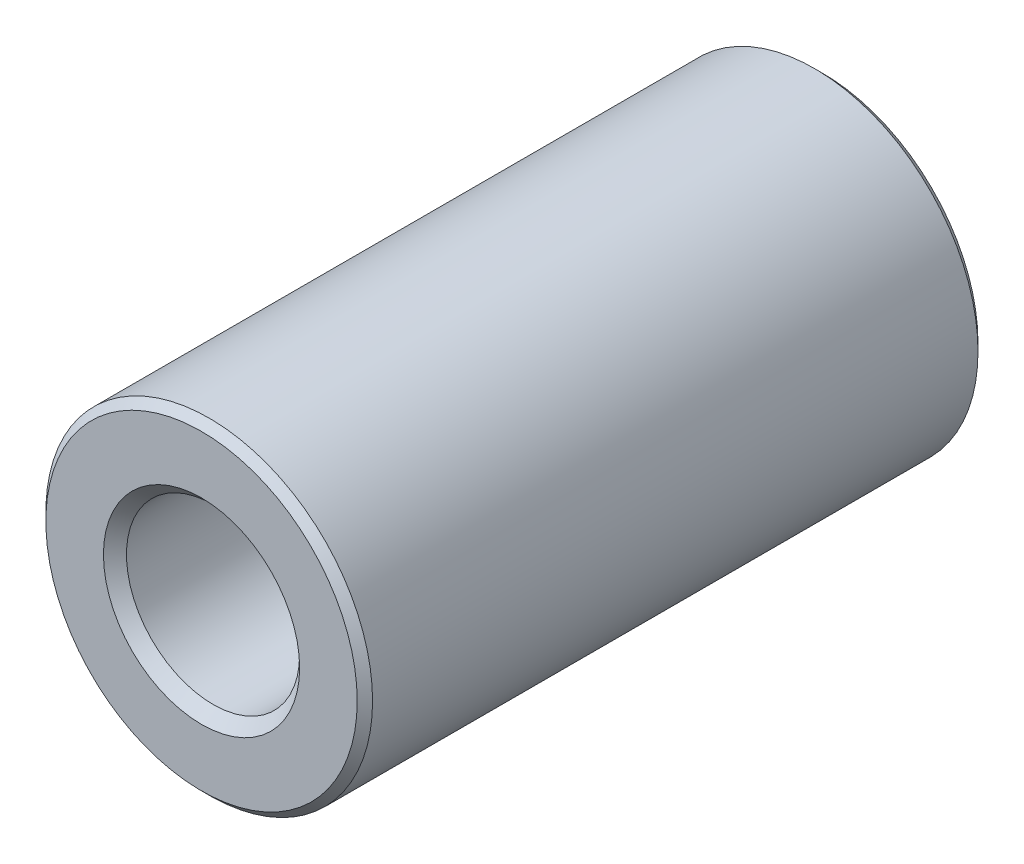
ISO-10303-21;
HEADER;
FILE_DESCRIPTION(('STEP AP214'),'2;1');
FILE_NAME('part.step','',(''),(''),'','','');
FILE_SCHEMA(('AUTOMOTIVE_DESIGN { 1 0 10303 214 1 1 1 1 }'));
ENDSEC;
DATA;
#1=APPLICATION_CONTEXT('core data for automotive mechanical design processes');
#2=APPLICATION_PROTOCOL_DEFINITION('international standard','automotive_design',2000,#1);
#3=PRODUCT_CONTEXT('',#1,'mechanical');
#4=PRODUCT('Part','Part','',(#3));
#5=PRODUCT_RELATED_PRODUCT_CATEGORY('part','',(#4));
#6=PRODUCT_DEFINITION_FORMATION('','',#4);
#7=PRODUCT_DEFINITION_CONTEXT('part definition',#1,'design');
#8=PRODUCT_DEFINITION('design','',#6,#7);
#9=PRODUCT_DEFINITION_SHAPE('','',#8);
#10=(LENGTH_UNIT() NAMED_UNIT(*) SI_UNIT(.MILLI.,.METRE.));
#11=(NAMED_UNIT(*) PLANE_ANGLE_UNIT() SI_UNIT($,.RADIAN.));
#12=(NAMED_UNIT(*) SI_UNIT($,.STERADIAN.) SOLID_ANGLE_UNIT());
#13=UNCERTAINTY_MEASURE_WITH_UNIT(LENGTH_MEASURE(1.E-05),#10,'distance_accuracy_value','');
#14=(GEOMETRIC_REPRESENTATION_CONTEXT(3) GLOBAL_UNCERTAINTY_ASSIGNED_CONTEXT((#13)) GLOBAL_UNIT_ASSIGNED_CONTEXT((#10,
#11,#12)) REPRESENTATION_CONTEXT('',''));
#15=CARTESIAN_POINT('',(0.,0.,0.));
#16=DIRECTION('',(0.,0.,1.));
#17=DIRECTION('',(1.,0.,0.));
#18=AXIS2_PLACEMENT_3D('',#15,#16,#17);
#19=CARTESIAN_POINT('',(0.,0.,-9.5));
#20=DIRECTION('',(0.,0.,1.));
#21=DIRECTION('',(1.,0.,0.));
#22=AXIS2_PLACEMENT_3D('',#19,#20,#21);
#23=CYLINDRICAL_SURFACE('',#22,5.);
#24=CARTESIAN_POINT('',(0.,0.,9.265));
#25=DIRECTION('',(0.,0.,1.));
#26=DIRECTION('',(1.,0.,0.));
#27=AXIS2_PLACEMENT_3D('',#24,#25,#26);
#28=CIRCLE('',#27,5.);
#29=CARTESIAN_POINT('',(5.,0.,9.265));
#30=VERTEX_POINT('',#29);
#31=EDGE_CURVE('E58',#30,#30,#28,.F.);
#32=ORIENTED_EDGE('',*,*,#31,.T.);
#33=EDGE_LOOP('',(#32));
#34=FACE_BOUND('',#33,.T.);
#35=CARTESIAN_POINT('',(0.,0.,-9.265));
#36=DIRECTION('',(0.,0.,1.));
#37=DIRECTION('',(1.,0.,0.));
#38=AXIS2_PLACEMENT_3D('',#35,#36,#37);
#39=CIRCLE('',#38,5.);
#40=CARTESIAN_POINT('',(5.,0.,-9.265));
#41=VERTEX_POINT('',#40);
#42=EDGE_CURVE('E61',#41,#41,#39,.T.);
#43=ORIENTED_EDGE('',*,*,#42,.T.);
#44=EDGE_LOOP('',(#43));
#45=FACE_BOUND('',#44,.T.);
#46=ADVANCED_FACE('F35',(#34,#45),#23,.T.);
#47=CARTESIAN_POINT('',(0.,0.,-9.5));
#48=DIRECTION('',(0.,0.,1.));
#49=DIRECTION('',(1.,0.,0.));
#50=AXIS2_PLACEMENT_3D('',#47,#48,#49);
#51=PLANE('',#50);
#52=CARTESIAN_POINT('',(0.,0.,-9.5));
#53=DIRECTION('',(0.,0.,1.));
#54=DIRECTION('',(1.,0.,0.));
#55=AXIS2_PLACEMENT_3D('',#52,#53,#54);
#56=CIRCLE('',#55,3.0025);
#57=CARTESIAN_POINT('',(3.0025,0.,-9.5));
#58=VERTEX_POINT('',#57);
#59=EDGE_CURVE('E10',#58,#58,#56,.T.);
#60=ORIENTED_EDGE('',*,*,#59,.T.);
#61=EDGE_LOOP('',(#60));
#62=FACE_BOUND('',#61,.T.);
#63=CARTESIAN_POINT('',(0.,0.,-9.5));
#64=DIRECTION('',(0.,0.,1.));
#65=DIRECTION('',(1.,0.,0.));
#66=AXIS2_PLACEMENT_3D('',#63,#64,#65);
#67=CIRCLE('',#66,4.765);
#68=CARTESIAN_POINT('',(4.765,0.,-9.5));
#69=VERTEX_POINT('',#68);
#70=EDGE_CURVE('E55',#69,#69,#67,.F.);
#71=ORIENTED_EDGE('',*,*,#70,.T.);
#72=EDGE_LOOP('',(#71));
#73=FACE_BOUND('',#72,.T.);
#74=ADVANCED_FACE('F87',(#62,#73),#51,.F.);
#75=CARTESIAN_POINT('',(0.,0.,-9.5));
#76=DIRECTION('',(0.,0.,1.));
#77=DIRECTION('',(1.,0.,0.));
#78=AXIS2_PLACEMENT_3D('',#75,#76,#77);
#79=CYLINDRICAL_SURFACE('',#78,2.65);
#80=CARTESIAN_POINT('',(0.,0.,9.1475));
#81=DIRECTION('',(0.,0.,1.));
#82=DIRECTION('',(1.,0.,0.));
#83=AXIS2_PLACEMENT_3D('',#80,#81,#82);
#84=CIRCLE('',#83,2.65);
#85=CARTESIAN_POINT('',(2.65,0.,9.1475));
#86=VERTEX_POINT('',#85);
#87=EDGE_CURVE('E46',#86,#86,#84,.T.);
#88=ORIENTED_EDGE('',*,*,#87,.T.);
#89=EDGE_LOOP('',(#88));
#90=FACE_BOUND('',#89,.T.);
#91=CARTESIAN_POINT('',(0.,0.,-9.1475));
#92=DIRECTION('',(0.,0.,1.));
#93=DIRECTION('',(1.,0.,0.));
#94=AXIS2_PLACEMENT_3D('',#91,#92,#93);
#95=CIRCLE('',#94,2.65);
#96=CARTESIAN_POINT('',(2.65,0.,-9.1475));
#97=VERTEX_POINT('',#96);
#98=EDGE_CURVE('E50',#97,#97,#95,.F.);
#99=ORIENTED_EDGE('',*,*,#98,.T.);
#100=EDGE_LOOP('',(#99));
#101=FACE_BOUND('',#100,.T.);
#102=ADVANCED_FACE('F83',(#90,#101),#79,.F.);
#103=CARTESIAN_POINT('',(0.,0.,9.5));
#104=DIRECTION('',(0.,0.,1.));
#105=DIRECTION('',(1.,0.,0.));
#106=AXIS2_PLACEMENT_3D('',#103,#104,#105);
#107=PLANE('',#106);
#108=CARTESIAN_POINT('',(0.,0.,9.5));
#109=DIRECTION('',(0.,0.,1.));
#110=DIRECTION('',(1.,0.,0.));
#111=AXIS2_PLACEMENT_3D('',#108,#109,#110);
#112=CIRCLE('',#111,3.0025);
#113=CARTESIAN_POINT('',(3.0025,0.,9.5));
#114=VERTEX_POINT('',#113);
#115=EDGE_CURVE('E42',#114,#114,#112,.F.);
#116=ORIENTED_EDGE('',*,*,#115,.T.);
#117=EDGE_LOOP('',(#116));
#118=FACE_BOUND('',#117,.T.);
#119=CARTESIAN_POINT('',(0.,0.,9.5));
#120=DIRECTION('',(0.,0.,1.));
#121=DIRECTION('',(1.,0.,0.));
#122=AXIS2_PLACEMENT_3D('',#119,#120,#121);
#123=CIRCLE('',#122,4.76500000000001);
#124=CARTESIAN_POINT('',(4.76500000000001,0.,9.5));
#125=VERTEX_POINT('',#124);
#126=EDGE_CURVE('E64',#125,#125,#123,.T.);
#127=ORIENTED_EDGE('',*,*,#126,.T.);
#128=EDGE_LOOP('',(#127));
#129=FACE_BOUND('',#128,.T.);
#130=ADVANCED_FACE('F68',(#118,#129),#107,.T.);
#131=CARTESIAN_POINT('',(0.,0.,9.5));
#132=DIRECTION('',(0.,0.,-1.));
#133=DIRECTION('',(-1.,0.,0.));
#134=AXIS2_PLACEMENT_3D('',#131,#132,#133);
#135=CONICAL_SURFACE('',#134,4.76500000000001,0.785398163397446);
#136=ORIENTED_EDGE('',*,*,#31,.F.);
#137=EDGE_LOOP('',(#136));
#138=FACE_BOUND('',#137,.T.);
#139=ORIENTED_EDGE('',*,*,#126,.F.);
#140=EDGE_LOOP('',(#139));
#141=FACE_BOUND('',#140,.T.);
#142=ADVANCED_FACE('F70',(#138,#141),#135,.T.);
#143=CARTESIAN_POINT('',(0.,0.,-9.265));
#144=DIRECTION('',(0.,0.,1.));
#145=DIRECTION('',(1.,0.,0.));
#146=AXIS2_PLACEMENT_3D('',#143,#144,#145);
#147=CONICAL_SURFACE('',#146,5.,0.78539816339745);
#148=CARTESIAN_POINT('',(4.765,0.,-9.5));
#149=CARTESIAN_POINT('',(4.76744791666666,0.,-9.49755208333333));
#150=CARTESIAN_POINT('',(4.76989583333333,0.,-9.49510416666667));
#151=CARTESIAN_POINT('',(4.77479166666666,0.,-9.49020833333333));
#152=CARTESIAN_POINT('',(4.77723958333333,0.,-9.48776041666667));
#153=CARTESIAN_POINT('',(4.78213541666666,0.,-9.48286458333333));
#154=CARTESIAN_POINT('',(4.78458333333333,0.,-9.48041666666667));
#155=CARTESIAN_POINT('',(4.78947916666666,0.,-9.47552083333333));
#156=CARTESIAN_POINT('',(4.79192708333333,0.,-9.47307291666667));
#157=CARTESIAN_POINT('',(4.79682291666666,0.,-9.46817708333333));
#158=CARTESIAN_POINT('',(4.79927083333333,0.,-9.46572916666667));
#159=CARTESIAN_POINT('',(4.80416666666666,0.,-9.46083333333333));
#160=CARTESIAN_POINT('',(4.80661458333333,0.,-9.45838541666667));
#161=CARTESIAN_POINT('',(4.81151041666666,0.,-9.45348958333333));
#162=CARTESIAN_POINT('',(4.81395833333333,0.,-9.45104166666667));
#163=CARTESIAN_POINT('',(4.81885416666666,0.,-9.44614583333333));
#164=CARTESIAN_POINT('',(4.82130208333333,0.,-9.44369791666667));
#165=CARTESIAN_POINT('',(4.82619791666666,0.,-9.43880208333333));
#166=CARTESIAN_POINT('',(4.82864583333333,0.,-9.43635416666667));
#167=CARTESIAN_POINT('',(4.83354166666666,0.,-9.43145833333333));
#168=CARTESIAN_POINT('',(4.83598958333333,0.,-9.42901041666667));
#169=CARTESIAN_POINT('',(4.84088541666666,0.,-9.42411458333333));
#170=CARTESIAN_POINT('',(4.84333333333333,0.,-9.42166666666667));
#171=CARTESIAN_POINT('',(4.84822916666666,0.,-9.41677083333333));
#172=CARTESIAN_POINT('',(4.85067708333333,0.,-9.41432291666667));
#173=CARTESIAN_POINT('',(4.85557291666666,0.,-9.40942708333333));
#174=CARTESIAN_POINT('',(4.85802083333333,0.,-9.40697916666667));
#175=CARTESIAN_POINT('',(4.86291666666666,0.,-9.40208333333333));
#176=CARTESIAN_POINT('',(4.86536458333333,0.,-9.39963541666667));
#177=CARTESIAN_POINT('',(4.87026041666666,0.,-9.39473958333333));
#178=CARTESIAN_POINT('',(4.87270833333333,0.,-9.39229166666667));
#179=CARTESIAN_POINT('',(4.87760416666666,0.,-9.38739583333333));
#180=CARTESIAN_POINT('',(4.88005208333333,0.,-9.38494791666666));
#181=CARTESIAN_POINT('',(4.88494791666666,0.,-9.38005208333333));
#182=CARTESIAN_POINT('',(4.88739583333333,0.,-9.37760416666667));
#183=CARTESIAN_POINT('',(4.89229166666666,0.,-9.37270833333333));
#184=CARTESIAN_POINT('',(4.89473958333333,0.,-9.37026041666667));
#185=CARTESIAN_POINT('',(4.89963541666666,0.,-9.36536458333333));
#186=CARTESIAN_POINT('',(4.90208333333333,0.,-9.36291666666667));
#187=CARTESIAN_POINT('',(4.90697916666666,0.,-9.35802083333333));
#188=CARTESIAN_POINT('',(4.90942708333333,0.,-9.35557291666667));
#189=CARTESIAN_POINT('',(4.91432291666666,0.,-9.35067708333333));
#190=CARTESIAN_POINT('',(4.91677083333333,0.,-9.34822916666667));
#191=CARTESIAN_POINT('',(4.92166666666667,0.,-9.34333333333333));
#192=CARTESIAN_POINT('',(4.92411458333333,0.,-9.34088541666667));
#193=CARTESIAN_POINT('',(4.92901041666666,0.,-9.33598958333333));
#194=CARTESIAN_POINT('',(4.93145833333333,0.,-9.33354166666667));
#195=CARTESIAN_POINT('',(4.93635416666666,0.,-9.32864583333333));
#196=CARTESIAN_POINT('',(4.93880208333333,0.,-9.32619791666667));
#197=CARTESIAN_POINT('',(4.94369791666666,0.,-9.32130208333333));
#198=CARTESIAN_POINT('',(4.94614583333333,0.,-9.31885416666667));
#199=CARTESIAN_POINT('',(4.95104166666667,0.,-9.31395833333333));
#200=CARTESIAN_POINT('',(4.95348958333333,0.,-9.31151041666667));
#201=CARTESIAN_POINT('',(4.95838541666666,0.,-9.30661458333333));
#202=CARTESIAN_POINT('',(4.96083333333333,0.,-9.30416666666667));
#203=CARTESIAN_POINT('',(4.96572916666666,0.,-9.29927083333333));
#204=CARTESIAN_POINT('',(4.96817708333333,0.,-9.29682291666667));
#205=CARTESIAN_POINT('',(4.97307291666667,0.,-9.29192708333333));
#206=CARTESIAN_POINT('',(4.97552083333333,0.,-9.28947916666666));
#207=CARTESIAN_POINT('',(4.98041666666667,0.,-9.28458333333333));
#208=CARTESIAN_POINT('',(4.98286458333333,0.,-9.28213541666667));
#209=CARTESIAN_POINT('',(4.98776041666667,0.,-9.27723958333333));
#210=CARTESIAN_POINT('',(4.99020833333333,0.,-9.27479166666667));
#211=CARTESIAN_POINT('',(4.99510416666667,0.,-9.26989583333333));
#212=CARTESIAN_POINT('',(4.99755208333333,0.,-9.26744791666667));
#213=CARTESIAN_POINT('',(5.,0.,-9.265));
#214=B_SPLINE_CURVE_WITH_KNOTS('',3,(#148,#149,#150,#151,#152,#153,#154,#155,#156,#157,#158,
#159,#160,#161,#162,#163,#164,#165,#166,#167,#168,#169,#170,#171,#172,#173,#174,#175,#176,#177,
#178,#179,#180,#181,#182,#183,#184,#185,#186,#187,#188,#189,#190,#191,#192,#193,#194,#195,#196,
#197,#198,#199,#200,#201,#202,#203,#204,#205,#206,#207,#208,#209,#210,#211,#212,#213),
.UNSPECIFIED.,.F.,.F.,(4,2,2,2,2,2,2,2,2,2,2,2,2,2,2,2,2,2,2,2,2,2,2,2,2,2,2,2,2,2,2,2,4),(0.,
0.0103856308486774,0.0207712616973541,0.0311568925460315,0.0415425233947101,0.0519281542433869,
0.0623137850920643,0.0726994159407429,0.0830850467894196,0.093470677638097,0.103856308486776,
0.114241939335452,0.12462757018413,0.135013201032808,0.145398831881485,0.155784462730162,
0.166170093578841,0.176555724427518,0.186941355276195,0.197326986124872,0.207712616973551,
0.218098247822228,0.228483878670905,0.238869509519583,0.249255140368261,0.259640771216937,
0.270026402065616,0.280412032914293,0.29079766376297,0.301183294611649,0.311568925460326,
0.321954556309003,0.332340187157681),.UNSPECIFIED.);
#215=EDGE_CURVE('BSEAM72',#69,#41,#214,.T.);
#216=ORIENTED_EDGE('',*,*,#70,.F.);
#217=ORIENTED_EDGE('',*,*,#42,.F.);
#218=ORIENTED_EDGE('',*,*,#215,.T.);
#219=ORIENTED_EDGE('',*,*,#215,.F.);
#220=EDGE_LOOP('',(#216,#218,#217,#219));
#221=FACE_BOUND('',#220,.T.);
#222=ADVANCED_FACE('F72',(#221),#147,.T.);
#223=CARTESIAN_POINT('',(0.,0.,9.1475));
#224=DIRECTION('',(0.,0.,1.));
#225=DIRECTION('',(1.,0.,0.));
#226=AXIS2_PLACEMENT_3D('',#223,#224,#225);
#227=CONICAL_SURFACE('',#226,2.65,0.785398163397453);
#228=ORIENTED_EDGE('',*,*,#115,.F.);
#229=EDGE_LOOP('',(#228));
#230=FACE_BOUND('',#229,.T.);
#231=ORIENTED_EDGE('',*,*,#87,.F.);
#232=EDGE_LOOP('',(#231));
#233=FACE_BOUND('',#232,.T.);
#234=ADVANCED_FACE('F79',(#230,#233),#227,.F.);
#235=CARTESIAN_POINT('',(0.,0.,-9.5));
#236=DIRECTION('',(0.,0.,-1.));
#237=DIRECTION('',(-1.,0.,0.));
#238=AXIS2_PLACEMENT_3D('',#235,#236,#237);
#239=CONICAL_SURFACE('',#238,3.0025,0.785398163397445);
#240=ORIENTED_EDGE('',*,*,#98,.F.);
#241=EDGE_LOOP('',(#240));
#242=FACE_BOUND('',#241,.T.);
#243=ORIENTED_EDGE('',*,*,#59,.F.);
#244=EDGE_LOOP('',(#243));
#245=FACE_BOUND('',#244,.T.);
#246=ADVANCED_FACE('F37',(#242,#245),#239,.F.);
#247=CLOSED_SHELL('',(#46,#74,#102,#130,#142,#222,#234,#246));
#248=MANIFOLD_SOLID_BREP('B2',#247);
#249=ADVANCED_BREP_SHAPE_REPRESENTATION('',(#18,#248),#14);
#250=SHAPE_DEFINITION_REPRESENTATION(#9,#249);
ENDSEC;
END-ISO-10303-21;
